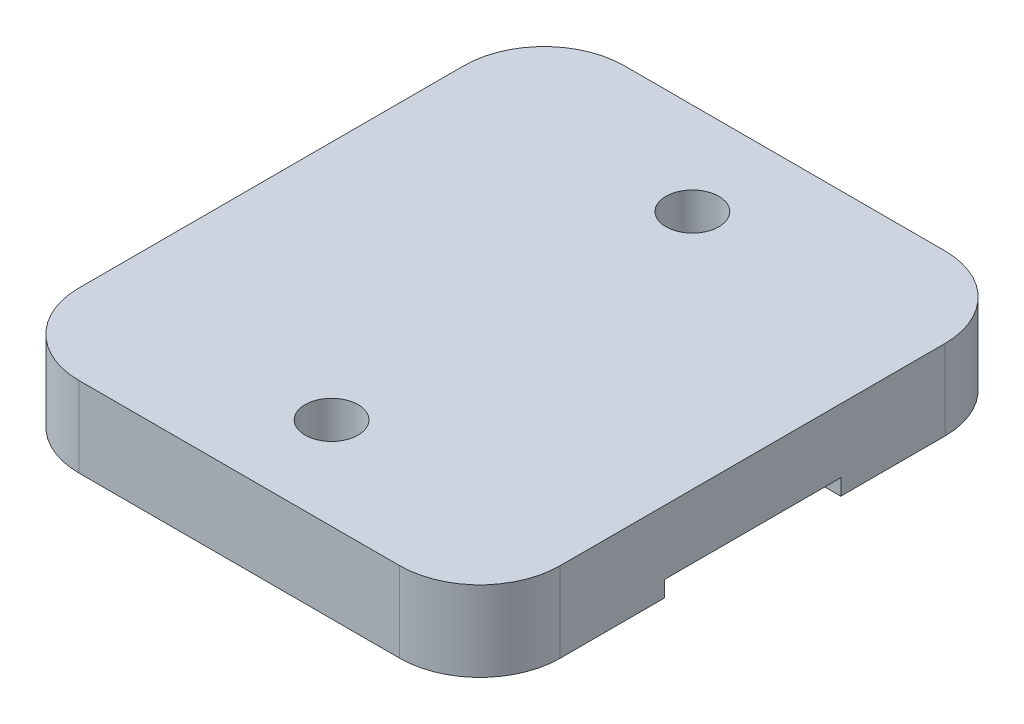
ISO-10303-21;
HEADER;
FILE_DESCRIPTION(('STEP AP214'),'2;1');
FILE_NAME('part.step','',(''),(''),'','','');
FILE_SCHEMA(('AUTOMOTIVE_DESIGN { 1 0 10303 214 1 1 1 1 }'));
ENDSEC;
DATA;
#1=APPLICATION_CONTEXT('core data for automotive mechanical design processes');
#2=APPLICATION_PROTOCOL_DEFINITION('international standard','automotive_design',2000,#1);
#3=PRODUCT_CONTEXT('',#1,'mechanical');
#4=PRODUCT('Part','Part','',(#3));
#5=PRODUCT_RELATED_PRODUCT_CATEGORY('part','',(#4));
#6=PRODUCT_DEFINITION_FORMATION('','',#4);
#7=PRODUCT_DEFINITION_CONTEXT('part definition',#1,'design');
#8=PRODUCT_DEFINITION('design','',#6,#7);
#9=PRODUCT_DEFINITION_SHAPE('','',#8);
#10=(LENGTH_UNIT() NAMED_UNIT(*) SI_UNIT(.MILLI.,.METRE.));
#11=(NAMED_UNIT(*) PLANE_ANGLE_UNIT() SI_UNIT($,.RADIAN.));
#12=(NAMED_UNIT(*) SI_UNIT($,.STERADIAN.) SOLID_ANGLE_UNIT());
#13=UNCERTAINTY_MEASURE_WITH_UNIT(LENGTH_MEASURE(1.E-05),#10,'distance_accuracy_value','');
#14=(GEOMETRIC_REPRESENTATION_CONTEXT(3) GLOBAL_UNCERTAINTY_ASSIGNED_CONTEXT((#13)) GLOBAL_UNIT_ASSIGNED_CONTEXT((#10,
#11,#12)) REPRESENTATION_CONTEXT('',''));
#15=CARTESIAN_POINT('',(0.,0.,0.));
#16=DIRECTION('',(0.,0.,1.));
#17=DIRECTION('',(1.,0.,0.));
#18=AXIS2_PLACEMENT_3D('',#15,#16,#17);
#19=CARTESIAN_POINT('',(0.,-5.,0.));
#20=DIRECTION('',(0.,-1.,0.));
#21=DIRECTION('',(0.,0.,-1.));
#22=AXIS2_PLACEMENT_3D('',#19,#20,#21);
#23=PLANE('',#22);
#24=CARTESIAN_POINT('',(0.,-5.,-11.25));
#25=DIRECTION('',(0.,-1.,0.));
#26=DIRECTION('',(0.,0.,1.));
#27=AXIS2_PLACEMENT_3D('',#24,#25,#26);
#28=CIRCLE('',#27,1.64999999999999);
#29=CARTESIAN_POINT('',(0.,-5.,-9.60000000000001));
#30=VERTEX_POINT('',#29);
#31=EDGE_CURVE('E286',#30,#30,#28,.T.);
#32=ORIENTED_EDGE('',*,*,#31,.F.);
#33=EDGE_LOOP('',(#32));
#34=FACE_BOUND('',#33,.T.);
#35=DIRECTION('',(0.,0.,-1.));
#36=VECTOR('',#35,1.);
#37=CARTESIAN_POINT('',(-15.,-5.,17.));
#38=LINE('',#37,#36);
#39=CARTESIAN_POINT('',(-15.,-5.,-5.5));
#40=VERTEX_POINT('',#39);
#41=CARTESIAN_POINT('',(-15.,-5.,-12.));
#42=VERTEX_POINT('',#41);
#43=EDGE_CURVE('E184',#40,#42,#38,.T.);
#44=ORIENTED_EDGE('',*,*,#43,.T.);
#45=CARTESIAN_POINT('',(-10.,-5.,-12.));
#46=DIRECTION('',(0.,-1.,0.));
#47=DIRECTION('',(0.,0.,-1.));
#48=AXIS2_PLACEMENT_3D('',#45,#46,#47);
#49=CIRCLE('',#48,5.);
#50=CARTESIAN_POINT('',(-10.,-5.,-17.));
#51=VERTEX_POINT('',#50);
#52=EDGE_CURVE('E59',#42,#51,#49,.T.);
#53=ORIENTED_EDGE('',*,*,#52,.T.);
#54=DIRECTION('',(1.,0.,0.));
#55=VECTOR('',#54,1.);
#56=CARTESIAN_POINT('',(-15.,-5.,-17.));
#57=LINE('',#56,#55);
#58=CARTESIAN_POINT('',(10.,-5.,-17.));
#59=VERTEX_POINT('',#58);
#60=EDGE_CURVE('E187',#51,#59,#57,.T.);
#61=ORIENTED_EDGE('',*,*,#60,.T.);
#62=CARTESIAN_POINT('',(10.,-5.,-12.));
#63=DIRECTION('',(0.,-1.,0.));
#64=DIRECTION('',(0.,0.,-1.));
#65=AXIS2_PLACEMENT_3D('',#62,#63,#64);
#66=CIRCLE('',#65,5.);
#67=CARTESIAN_POINT('',(15.,-5.,-12.));
#68=VERTEX_POINT('',#67);
#69=EDGE_CURVE('E51',#59,#68,#66,.T.);
#70=ORIENTED_EDGE('',*,*,#69,.T.);
#71=DIRECTION('',(0.,0.,1.));
#72=VECTOR('',#71,1.);
#73=CARTESIAN_POINT('',(15.,-5.,-17.));
#74=LINE('',#73,#72);
#75=CARTESIAN_POINT('',(15.,-5.,-5.5));
#76=VERTEX_POINT('',#75);
#77=EDGE_CURVE('E125',#68,#76,#74,.T.);
#78=ORIENTED_EDGE('',*,*,#77,.T.);
#79=DIRECTION('',(-1.,0.,0.));
#80=VECTOR('',#79,1.);
#81=CARTESIAN_POINT('',(15.,-5.,-5.5));
#82=LINE('',#81,#80);
#83=EDGE_CURVE('E127',#76,#40,#82,.T.);
#84=ORIENTED_EDGE('',*,*,#83,.T.);
#85=EDGE_LOOP('',(#44,#53,#61,#70,#78,#84));
#86=FACE_BOUND('',#85,.T.);
#87=ADVANCED_FACE('F36',(#34,#86),#23,.T.);
#88=CARTESIAN_POINT('',(15.,0.,17.));
#89=DIRECTION('',(0.,0.,1.));
#90=DIRECTION('',(1.,0.,0.));
#91=AXIS2_PLACEMENT_3D('',#88,#89,#90);
#92=PLANE('',#91);
#93=DIRECTION('',(-1.,0.,0.));
#94=VECTOR('',#93,1.);
#95=CARTESIAN_POINT('',(15.,0.,17.));
#96=LINE('',#95,#94);
#97=CARTESIAN_POINT('',(10.,0.,17.));
#98=VERTEX_POINT('',#97);
#99=CARTESIAN_POINT('',(-10.,0.,17.));
#100=VERTEX_POINT('',#99);
#101=EDGE_CURVE('E131',#98,#100,#96,.T.);
#102=ORIENTED_EDGE('',*,*,#101,.T.);
#103=DIRECTION('',(0.,-1.,0.));
#104=VECTOR('',#103,1.);
#105=CARTESIAN_POINT('',(-10.,0.,17.));
#106=LINE('',#105,#104);
#107=CARTESIAN_POINT('',(-10.,-5.,17.));
#108=VERTEX_POINT('',#107);
#109=EDGE_CURVE('E190',#100,#108,#106,.T.);
#110=ORIENTED_EDGE('',*,*,#109,.T.);
#111=DIRECTION('',(-1.,0.,0.));
#112=VECTOR('',#111,1.);
#113=CARTESIAN_POINT('',(15.,-5.,17.));
#114=LINE('',#113,#112);
#115=CARTESIAN_POINT('',(10.,-5.,17.));
#116=VERTEX_POINT('',#115);
#117=EDGE_CURVE('E166',#116,#108,#114,.T.);
#118=ORIENTED_EDGE('',*,*,#117,.F.);
#119=DIRECTION('',(0.,-1.,0.));
#120=VECTOR('',#119,1.);
#121=CARTESIAN_POINT('',(10.,0.,17.));
#122=LINE('',#121,#120);
#123=EDGE_CURVE('E181',#116,#98,#122,.F.);
#124=ORIENTED_EDGE('',*,*,#123,.T.);
#125=EDGE_LOOP('',(#102,#110,#118,#124));
#126=FACE_BOUND('',#125,.T.);
#127=ADVANCED_FACE('F239',(#126),#92,.T.);
#128=CARTESIAN_POINT('',(15.,0.,-17.));
#129=DIRECTION('',(1.,0.,0.));
#130=DIRECTION('',(0.,0.,-1.));
#131=AXIS2_PLACEMENT_3D('',#128,#129,#130);
#132=PLANE('',#131);
#133=DIRECTION('',(0.,0.,1.));
#134=VECTOR('',#133,1.);
#135=CARTESIAN_POINT('',(15.,0.,-17.));
#136=LINE('',#135,#134);
#137=CARTESIAN_POINT('',(15.,0.,-12.));
#138=VERTEX_POINT('',#137);
#139=CARTESIAN_POINT('',(15.,0.,12.));
#140=VERTEX_POINT('',#139);
#141=EDGE_CURVE('E179',#138,#140,#136,.T.);
#142=ORIENTED_EDGE('',*,*,#141,.T.);
#143=DIRECTION('',(0.,-1.,0.));
#144=VECTOR('',#143,1.);
#145=CARTESIAN_POINT('',(15.,0.,12.));
#146=LINE('',#145,#144);
#147=CARTESIAN_POINT('',(15.,-5.,12.));
#148=VERTEX_POINT('',#147);
#149=EDGE_CURVE('E212',#140,#148,#146,.T.);
#150=ORIENTED_EDGE('',*,*,#149,.T.);
#151=CARTESIAN_POINT('',(15.,-5.,5.5));
#152=VERTEX_POINT('',#151);
#153=EDGE_CURVE('E132',#152,#148,#74,.T.);
#154=ORIENTED_EDGE('',*,*,#153,.F.);
#155=DIRECTION('',(0.,1.,0.));
#156=VECTOR('',#155,1.);
#157=CARTESIAN_POINT('',(15.,-5.,5.5));
#158=LINE('',#157,#156);
#159=CARTESIAN_POINT('',(15.,-4.,5.5));
#160=VERTEX_POINT('',#159);
#161=EDGE_CURVE('E148',#152,#160,#158,.T.);
#162=ORIENTED_EDGE('',*,*,#161,.T.);
#163=DIRECTION('',(0.,0.,-1.));
#164=VECTOR('',#163,1.);
#165=CARTESIAN_POINT('',(15.,-4.,5.5));
#166=LINE('',#165,#164);
#167=CARTESIAN_POINT('',(15.,-4.,-5.5));
#168=VERTEX_POINT('',#167);
#169=EDGE_CURVE('E142',#160,#168,#166,.T.);
#170=ORIENTED_EDGE('',*,*,#169,.T.);
#171=DIRECTION('',(0.,-1.,0.));
#172=VECTOR('',#171,1.);
#173=CARTESIAN_POINT('',(15.,-4.,-5.5));
#174=LINE('',#173,#172);
#175=EDGE_CURVE('E137',#168,#76,#174,.T.);
#176=ORIENTED_EDGE('',*,*,#175,.T.);
#177=ORIENTED_EDGE('',*,*,#77,.F.);
#178=DIRECTION('',(0.,-1.,0.));
#179=VECTOR('',#178,1.);
#180=CARTESIAN_POINT('',(15.,0.,-12.));
#181=LINE('',#180,#179);
#182=EDGE_CURVE('E210',#68,#138,#181,.F.);
#183=ORIENTED_EDGE('',*,*,#182,.T.);
#184=EDGE_LOOP('',(#142,#150,#154,#162,#170,#176,#177,#183));
#185=FACE_BOUND('',#184,.T.);
#186=ADVANCED_FACE('F145',(#185),#132,.T.);
#187=CARTESIAN_POINT('',(-15.,0.,-17.));
#188=DIRECTION('',(0.,0.,-1.));
#189=DIRECTION('',(-1.,0.,0.));
#190=AXIS2_PLACEMENT_3D('',#187,#188,#189);
#191=PLANE('',#190);
#192=ORIENTED_EDGE('',*,*,#60,.F.);
#193=DIRECTION('',(0.,-1.,0.));
#194=VECTOR('',#193,1.);
#195=CARTESIAN_POINT('',(-10.,0.,-17.));
#196=LINE('',#195,#194);
#197=CARTESIAN_POINT('',(-10.,0.,-17.));
#198=VERTEX_POINT('',#197);
#199=EDGE_CURVE('E11',#51,#198,#196,.F.);
#200=ORIENTED_EDGE('',*,*,#199,.T.);
#201=DIRECTION('',(1.,0.,0.));
#202=VECTOR('',#201,1.);
#203=CARTESIAN_POINT('',(-15.,0.,-17.));
#204=LINE('',#203,#202);
#205=CARTESIAN_POINT('',(10.,0.,-17.));
#206=VERTEX_POINT('',#205);
#207=EDGE_CURVE('E176',#198,#206,#204,.T.);
#208=ORIENTED_EDGE('',*,*,#207,.T.);
#209=DIRECTION('',(0.,-1.,0.));
#210=VECTOR('',#209,1.);
#211=CARTESIAN_POINT('',(10.,0.,-17.));
#212=LINE('',#211,#210);
#213=EDGE_CURVE('E44',#206,#59,#212,.T.);
#214=ORIENTED_EDGE('',*,*,#213,.T.);
#215=EDGE_LOOP('',(#192,#200,#208,#214));
#216=FACE_BOUND('',#215,.T.);
#217=ADVANCED_FACE('F217',(#216),#191,.T.);
#218=CARTESIAN_POINT('',(-15.,0.,17.));
#219=DIRECTION('',(-1.,0.,0.));
#220=DIRECTION('',(0.,0.,1.));
#221=AXIS2_PLACEMENT_3D('',#218,#219,#220);
#222=PLANE('',#221);
#223=CARTESIAN_POINT('',(-15.,-5.,12.));
#224=VERTEX_POINT('',#223);
#225=CARTESIAN_POINT('',(-15.,-5.,5.5));
#226=VERTEX_POINT('',#225);
#227=EDGE_CURVE('E185',#224,#226,#38,.T.);
#228=ORIENTED_EDGE('',*,*,#227,.F.);
#229=DIRECTION('',(0.,-1.,0.));
#230=VECTOR('',#229,1.);
#231=CARTESIAN_POINT('',(-15.,0.,12.));
#232=LINE('',#231,#230);
#233=CARTESIAN_POINT('',(-15.,0.,12.));
#234=VERTEX_POINT('',#233);
#235=EDGE_CURVE('E200',#224,#234,#232,.F.);
#236=ORIENTED_EDGE('',*,*,#235,.T.);
#237=DIRECTION('',(0.,0.,-1.));
#238=VECTOR('',#237,1.);
#239=CARTESIAN_POINT('',(-15.,0.,17.));
#240=LINE('',#239,#238);
#241=CARTESIAN_POINT('',(-15.,0.,-12.));
#242=VERTEX_POINT('',#241);
#243=EDGE_CURVE('E173',#234,#242,#240,.T.);
#244=ORIENTED_EDGE('',*,*,#243,.T.);
#245=DIRECTION('',(0.,-1.,0.));
#246=VECTOR('',#245,1.);
#247=CARTESIAN_POINT('',(-15.,0.,-12.));
#248=LINE('',#247,#246);
#249=EDGE_CURVE('E197',#242,#42,#248,.T.);
#250=ORIENTED_EDGE('',*,*,#249,.T.);
#251=ORIENTED_EDGE('',*,*,#43,.F.);
#252=DIRECTION('',(0.,-1.,0.));
#253=VECTOR('',#252,1.);
#254=CARTESIAN_POINT('',(-15.,-4.,-5.5));
#255=LINE('',#254,#253);
#256=CARTESIAN_POINT('',(-15.,-4.,-5.5));
#257=VERTEX_POINT('',#256);
#258=EDGE_CURVE('E140',#257,#40,#255,.T.);
#259=ORIENTED_EDGE('',*,*,#258,.F.);
#260=DIRECTION('',(0.,0.,-1.));
#261=VECTOR('',#260,1.);
#262=CARTESIAN_POINT('',(-15.,-4.,5.5));
#263=LINE('',#262,#261);
#264=CARTESIAN_POINT('',(-15.,-4.,5.5));
#265=VERTEX_POINT('',#264);
#266=EDGE_CURVE('E149',#265,#257,#263,.T.);
#267=ORIENTED_EDGE('',*,*,#266,.F.);
#268=DIRECTION('',(0.,1.,0.));
#269=VECTOR('',#268,1.);
#270=CARTESIAN_POINT('',(-15.,-5.,5.5));
#271=LINE('',#270,#269);
#272=EDGE_CURVE('E153',#226,#265,#271,.T.);
#273=ORIENTED_EDGE('',*,*,#272,.F.);
#274=EDGE_LOOP('',(#228,#236,#244,#250,#251,#259,#267,#273));
#275=FACE_BOUND('',#274,.T.);
#276=ADVANCED_FACE('F248',(#275),#222,.T.);
#277=CARTESIAN_POINT('',(0.,0.,0.));
#278=DIRECTION('',(0.,-1.,0.));
#279=DIRECTION('',(0.,0.,-1.));
#280=AXIS2_PLACEMENT_3D('',#277,#278,#279);
#281=PLANE('',#280);
#282=CARTESIAN_POINT('',(0.,0.,-11.25));
#283=DIRECTION('',(0.,-1.,0.));
#284=DIRECTION('',(0.,0.,1.));
#285=AXIS2_PLACEMENT_3D('',#282,#283,#284);
#286=CIRCLE('',#285,1.64999999999999);
#287=CARTESIAN_POINT('',(0.,0.,-9.60000000000001));
#288=VERTEX_POINT('',#287);
#289=EDGE_CURVE('E161',#288,#288,#286,.T.);
#290=ORIENTED_EDGE('',*,*,#289,.T.);
#291=EDGE_LOOP('',(#290));
#292=FACE_BOUND('',#291,.T.);
#293=CARTESIAN_POINT('',(0.,0.,11.25));
#294=DIRECTION('',(0.,-1.,0.));
#295=DIRECTION('',(0.,0.,-1.));
#296=AXIS2_PLACEMENT_3D('',#293,#294,#295);
#297=CIRCLE('',#296,1.64999999999999);
#298=CARTESIAN_POINT('',(0.,0.,9.60000000000001));
#299=VERTEX_POINT('',#298);
#300=EDGE_CURVE('E156',#299,#299,#297,.T.);
#301=ORIENTED_EDGE('',*,*,#300,.T.);
#302=EDGE_LOOP('',(#301));
#303=FACE_BOUND('',#302,.T.);
#304=ORIENTED_EDGE('',*,*,#243,.F.);
#305=CARTESIAN_POINT('',(-10.,0.,12.));
#306=DIRECTION('',(0.,-1.,0.));
#307=DIRECTION('',(0.,0.,-1.));
#308=AXIS2_PLACEMENT_3D('',#305,#306,#307);
#309=CIRCLE('',#308,5.);
#310=EDGE_CURVE('E208',#234,#100,#309,.F.);
#311=ORIENTED_EDGE('',*,*,#310,.T.);
#312=ORIENTED_EDGE('',*,*,#101,.F.);
#313=CARTESIAN_POINT('',(10.,0.,12.));
#314=DIRECTION('',(0.,-1.,0.));
#315=DIRECTION('',(0.,0.,-1.));
#316=AXIS2_PLACEMENT_3D('',#313,#314,#315);
#317=CIRCLE('',#316,5.);
#318=EDGE_CURVE('E206',#98,#140,#317,.F.);
#319=ORIENTED_EDGE('',*,*,#318,.T.);
#320=ORIENTED_EDGE('',*,*,#141,.F.);
#321=CARTESIAN_POINT('',(10.,0.,-12.));
#322=DIRECTION('',(0.,-1.,0.));
#323=DIRECTION('',(0.,0.,-1.));
#324=AXIS2_PLACEMENT_3D('',#321,#322,#323);
#325=CIRCLE('',#324,5.);
#326=EDGE_CURVE('E202',#138,#206,#325,.F.);
#327=ORIENTED_EDGE('',*,*,#326,.T.);
#328=ORIENTED_EDGE('',*,*,#207,.F.);
#329=CARTESIAN_POINT('',(-10.,0.,-12.));
#330=DIRECTION('',(0.,-1.,0.));
#331=DIRECTION('',(0.,0.,-1.));
#332=AXIS2_PLACEMENT_3D('',#329,#330,#331);
#333=CIRCLE('',#332,5.);
#334=EDGE_CURVE('E204',#198,#242,#333,.F.);
#335=ORIENTED_EDGE('',*,*,#334,.T.);
#336=EDGE_LOOP('',(#304,#311,#312,#319,#320,#327,#328,#335));
#337=FACE_BOUND('',#336,.T.);
#338=ADVANCED_FACE('F224',(#292,#303,#337),#281,.F.);
#339=CARTESIAN_POINT('',(0.,-5.,11.25));
#340=DIRECTION('',(0.,-1.,0.));
#341=DIRECTION('',(0.,0.,-1.));
#342=AXIS2_PLACEMENT_3D('',#339,#340,#341);
#343=CIRCLE('',#342,1.64999999999999);
#344=CARTESIAN_POINT('',(0.,-5.,9.60000000000001));
#345=VERTEX_POINT('',#344);
#346=EDGE_CURVE('E284',#345,#345,#343,.T.);
#347=ORIENTED_EDGE('',*,*,#346,.F.);
#348=EDGE_LOOP('',(#347));
#349=FACE_BOUND('',#348,.T.);
#350=ORIENTED_EDGE('',*,*,#117,.T.);
#351=CARTESIAN_POINT('',(-10.,-5.,12.));
#352=DIRECTION('',(0.,-1.,0.));
#353=DIRECTION('',(0.,0.,-1.));
#354=AXIS2_PLACEMENT_3D('',#351,#352,#353);
#355=CIRCLE('',#354,5.);
#356=EDGE_CURVE('E195',#108,#224,#355,.T.);
#357=ORIENTED_EDGE('',*,*,#356,.T.);
#358=ORIENTED_EDGE('',*,*,#227,.T.);
#359=DIRECTION('',(-1.,0.,0.));
#360=VECTOR('',#359,1.);
#361=CARTESIAN_POINT('',(15.,-5.,5.5));
#362=LINE('',#361,#360);
#363=EDGE_CURVE('E141',#152,#226,#362,.T.);
#364=ORIENTED_EDGE('',*,*,#363,.F.);
#365=ORIENTED_EDGE('',*,*,#153,.T.);
#366=CARTESIAN_POINT('',(10.,-5.,12.));
#367=DIRECTION('',(0.,-1.,0.));
#368=DIRECTION('',(0.,0.,-1.));
#369=AXIS2_PLACEMENT_3D('',#366,#367,#368);
#370=CIRCLE('',#369,5.);
#371=EDGE_CURVE('E193',#148,#116,#370,.T.);
#372=ORIENTED_EDGE('',*,*,#371,.T.);
#373=EDGE_LOOP('',(#350,#357,#358,#364,#365,#372));
#374=FACE_BOUND('',#373,.T.);
#375=ADVANCED_FACE('F236',(#349,#374),#23,.T.);
#376=CARTESIAN_POINT('',(15.,-4.,-5.5));
#377=DIRECTION('',(0.,0.,-1.));
#378=DIRECTION('',(-1.,0.,0.));
#379=AXIS2_PLACEMENT_3D('',#376,#377,#378);
#380=PLANE('',#379);
#381=ORIENTED_EDGE('',*,*,#258,.T.);
#382=ORIENTED_EDGE('',*,*,#83,.F.);
#383=ORIENTED_EDGE('',*,*,#175,.F.);
#384=DIRECTION('',(-1.,0.,0.));
#385=VECTOR('',#384,1.);
#386=CARTESIAN_POINT('',(15.,-4.,-5.5));
#387=LINE('',#386,#385);
#388=EDGE_CURVE('E164',#168,#257,#387,.T.);
#389=ORIENTED_EDGE('',*,*,#388,.T.);
#390=EDGE_LOOP('',(#381,#382,#383,#389));
#391=FACE_BOUND('',#390,.T.);
#392=ADVANCED_FACE('F136',(#391),#380,.F.);
#393=CARTESIAN_POINT('',(15.,-4.,5.5));
#394=DIRECTION('',(0.,1.,0.));
#395=DIRECTION('',(0.,0.,1.));
#396=AXIS2_PLACEMENT_3D('',#393,#394,#395);
#397=PLANE('',#396);
#398=ORIENTED_EDGE('',*,*,#266,.T.);
#399=ORIENTED_EDGE('',*,*,#388,.F.);
#400=ORIENTED_EDGE('',*,*,#169,.F.);
#401=DIRECTION('',(-1.,0.,0.));
#402=VECTOR('',#401,1.);
#403=CARTESIAN_POINT('',(15.,-4.,5.5));
#404=LINE('',#403,#402);
#405=EDGE_CURVE('E167',#160,#265,#404,.T.);
#406=ORIENTED_EDGE('',*,*,#405,.T.);
#407=EDGE_LOOP('',(#398,#399,#400,#406));
#408=FACE_BOUND('',#407,.T.);
#409=ADVANCED_FACE('F253',(#408),#397,.F.);
#410=CARTESIAN_POINT('',(15.,-5.,5.5));
#411=DIRECTION('',(0.,0.,1.));
#412=DIRECTION('',(1.,0.,0.));
#413=AXIS2_PLACEMENT_3D('',#410,#411,#412);
#414=PLANE('',#413);
#415=ORIENTED_EDGE('',*,*,#272,.T.);
#416=ORIENTED_EDGE('',*,*,#405,.F.);
#417=ORIENTED_EDGE('',*,*,#161,.F.);
#418=ORIENTED_EDGE('',*,*,#363,.T.);
#419=EDGE_LOOP('',(#415,#416,#417,#418));
#420=FACE_BOUND('',#419,.T.);
#421=ADVANCED_FACE('F251',(#420),#414,.F.);
#422=CARTESIAN_POINT('',(-10.,0.,12.));
#423=DIRECTION('',(0.,-1.,0.));
#424=DIRECTION('',(0.,0.,-1.));
#425=AXIS2_PLACEMENT_3D('',#422,#423,#424);
#426=CYLINDRICAL_SURFACE('',#425,5.);
#427=ORIENTED_EDGE('',*,*,#310,.F.);
#428=ORIENTED_EDGE('',*,*,#235,.F.);
#429=ORIENTED_EDGE('',*,*,#356,.F.);
#430=ORIENTED_EDGE('',*,*,#109,.F.);
#431=EDGE_LOOP('',(#427,#428,#429,#430));
#432=FACE_BOUND('',#431,.T.);
#433=ADVANCED_FACE('F243',(#432),#426,.T.);
#434=CARTESIAN_POINT('',(10.,0.,12.));
#435=DIRECTION('',(0.,-1.,0.));
#436=DIRECTION('',(0.,0.,-1.));
#437=AXIS2_PLACEMENT_3D('',#434,#435,#436);
#438=CYLINDRICAL_SURFACE('',#437,5.);
#439=ORIENTED_EDGE('',*,*,#318,.F.);
#440=ORIENTED_EDGE('',*,*,#123,.F.);
#441=ORIENTED_EDGE('',*,*,#371,.F.);
#442=ORIENTED_EDGE('',*,*,#149,.F.);
#443=EDGE_LOOP('',(#439,#440,#441,#442));
#444=FACE_BOUND('',#443,.T.);
#445=ADVANCED_FACE('F232',(#444),#438,.T.);
#446=CARTESIAN_POINT('',(-10.,0.,-12.));
#447=DIRECTION('',(0.,-1.,0.));
#448=DIRECTION('',(0.,0.,-1.));
#449=AXIS2_PLACEMENT_3D('',#446,#447,#448);
#450=CYLINDRICAL_SURFACE('',#449,5.);
#451=ORIENTED_EDGE('',*,*,#334,.F.);
#452=ORIENTED_EDGE('',*,*,#199,.F.);
#453=ORIENTED_EDGE('',*,*,#52,.F.);
#454=ORIENTED_EDGE('',*,*,#249,.F.);
#455=EDGE_LOOP('',(#451,#452,#453,#454));
#456=FACE_BOUND('',#455,.T.);
#457=ADVANCED_FACE('F256',(#456),#450,.T.);
#458=CARTESIAN_POINT('',(10.,0.,-12.));
#459=DIRECTION('',(0.,-1.,0.));
#460=DIRECTION('',(0.,0.,-1.));
#461=AXIS2_PLACEMENT_3D('',#458,#459,#460);
#462=CYLINDRICAL_SURFACE('',#461,5.);
#463=ORIENTED_EDGE('',*,*,#326,.F.);
#464=ORIENTED_EDGE('',*,*,#182,.F.);
#465=ORIENTED_EDGE('',*,*,#69,.F.);
#466=ORIENTED_EDGE('',*,*,#213,.F.);
#467=EDGE_LOOP('',(#463,#464,#465,#466));
#468=FACE_BOUND('',#467,.T.);
#469=ADVANCED_FACE('F38',(#468),#462,.T.);
#470=CARTESIAN_POINT('',(0.,0.,11.25));
#471=DIRECTION('',(0.,-1.,0.));
#472=DIRECTION('',(0.,0.,-1.));
#473=AXIS2_PLACEMENT_3D('',#470,#471,#472);
#474=CYLINDRICAL_SURFACE('',#473,1.64999999999999);
#475=ORIENTED_EDGE('',*,*,#300,.F.);
#476=EDGE_LOOP('',(#475));
#477=FACE_BOUND('',#476,.T.);
#478=ORIENTED_EDGE('',*,*,#346,.T.);
#479=EDGE_LOOP('',(#478));
#480=FACE_BOUND('',#479,.T.);
#481=ADVANCED_FACE('F262',(#477,#480),#474,.F.);
#482=CARTESIAN_POINT('',(0.,0.,-11.25));
#483=DIRECTION('',(0.,-1.,0.));
#484=DIRECTION('',(0.,0.,-1.));
#485=AXIS2_PLACEMENT_3D('',#482,#483,#484);
#486=CYLINDRICAL_SURFACE('',#485,1.64999999999999);
#487=ORIENTED_EDGE('',*,*,#289,.F.);
#488=EDGE_LOOP('',(#487));
#489=FACE_BOUND('',#488,.T.);
#490=ORIENTED_EDGE('',*,*,#31,.T.);
#491=EDGE_LOOP('',(#490));
#492=FACE_BOUND('',#491,.T.);
#493=ADVANCED_FACE('F295',(#489,#492),#486,.F.);
#494=CLOSED_SHELL('',(#87,#127,#186,#217,#276,#338,#375,#392,#409,#421,#433,#445,#457,#469,#481,#493));
#495=MANIFOLD_SOLID_BREP('B2',#494);
#496=ADVANCED_BREP_SHAPE_REPRESENTATION('',(#18,#495),#14);
#497=SHAPE_DEFINITION_REPRESENTATION(#9,#496);
ENDSEC;
END-ISO-10303-21;
